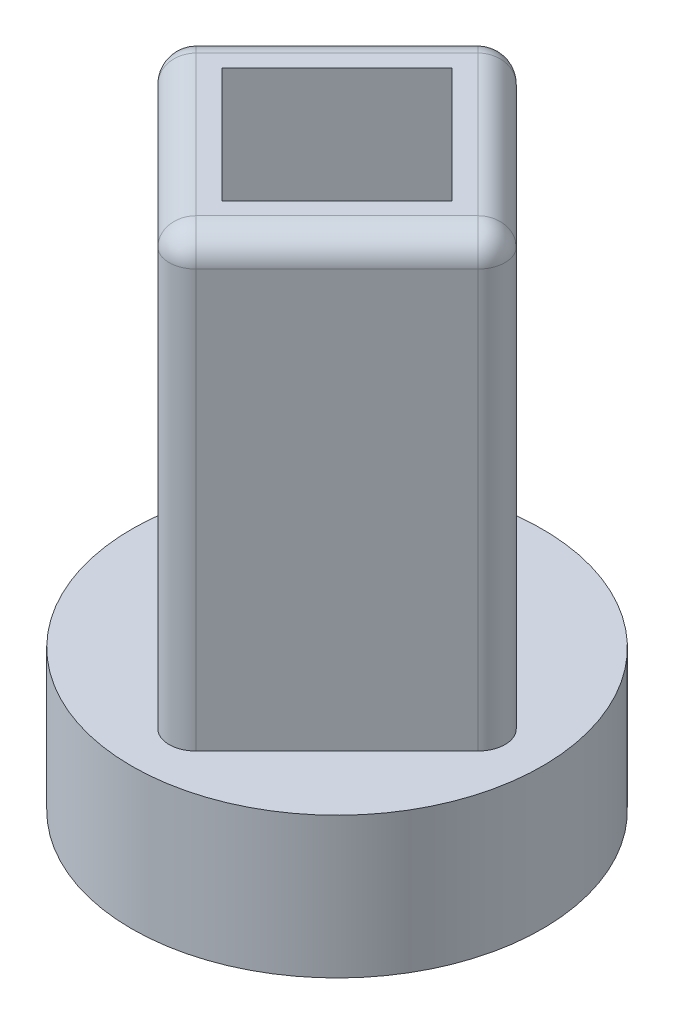
ISO-10303-21;
HEADER;
FILE_DESCRIPTION(('STEP AP214'),'2;1');
FILE_NAME('part.step','',(''),(''),'','','');
FILE_SCHEMA(('AUTOMOTIVE_DESIGN { 1 0 10303 214 1 1 1 1 }'));
ENDSEC;
DATA;
#1=APPLICATION_CONTEXT('core data for automotive mechanical design processes');
#2=APPLICATION_PROTOCOL_DEFINITION('international standard','automotive_design',2000,#1);
#3=PRODUCT_CONTEXT('',#1,'mechanical');
#4=PRODUCT('Part','Part','',(#3));
#5=PRODUCT_RELATED_PRODUCT_CATEGORY('part','',(#4));
#6=PRODUCT_DEFINITION_FORMATION('','',#4);
#7=PRODUCT_DEFINITION_CONTEXT('part definition',#1,'design');
#8=PRODUCT_DEFINITION('design','',#6,#7);
#9=PRODUCT_DEFINITION_SHAPE('','',#8);
#10=(LENGTH_UNIT() NAMED_UNIT(*) SI_UNIT(.MILLI.,.METRE.));
#11=(NAMED_UNIT(*) PLANE_ANGLE_UNIT() SI_UNIT($,.RADIAN.));
#12=(NAMED_UNIT(*) SI_UNIT($,.STERADIAN.) SOLID_ANGLE_UNIT());
#13=UNCERTAINTY_MEASURE_WITH_UNIT(LENGTH_MEASURE(1.E-05),#10,'distance_accuracy_value','');
#14=(GEOMETRIC_REPRESENTATION_CONTEXT(3) GLOBAL_UNCERTAINTY_ASSIGNED_CONTEXT((#13)) GLOBAL_UNIT_ASSIGNED_CONTEXT((#10,
#11,#12)) REPRESENTATION_CONTEXT('',''));
#15=CARTESIAN_POINT('',(0.,0.,0.));
#16=DIRECTION('',(0.,0.,1.));
#17=DIRECTION('',(1.,0.,0.));
#18=AXIS2_PLACEMENT_3D('',#15,#16,#17);
#19=CARTESIAN_POINT('',(0.,5.2,0.));
#20=DIRECTION('',(0.,1.,0.));
#21=DIRECTION('',(0.,0.,1.));
#22=AXIS2_PLACEMENT_3D('',#19,#20,#21);
#23=PLANE('',#22);
#24=CARTESIAN_POINT('',(0.,5.2,0.));
#25=DIRECTION('',(0.,1.,0.));
#26=DIRECTION('',(0.,0.,1.));
#27=AXIS2_PLACEMENT_3D('',#24,#25,#26);
#28=CIRCLE('',#27,7.575);
#29=CARTESIAN_POINT('',(0.,5.2,7.575));
#30=VERTEX_POINT('',#29);
#31=EDGE_CURVE('E253',#30,#30,#28,.T.);
#32=ORIENTED_EDGE('',*,*,#31,.T.);
#33=EDGE_LOOP('',(#32));
#34=FACE_BOUND('',#33,.T.);
#35=DIRECTION('',(-0.707106781186548,0.,-0.707106781186547));
#36=VECTOR('',#35,1.);
#37=CARTESIAN_POINT('',(6.61144840409422,5.2,0.));
#38=LINE('',#37,#36);
#39=CARTESIAN_POINT('',(5.90434162290767,5.2,-0.707106781186549));
#40=VERTEX_POINT('',#39);
#41=CARTESIAN_POINT('',(0.707106781186545,5.2,-5.90434162290767));
#42=VERTEX_POINT('',#41);
#43=EDGE_CURVE('E227',#40,#42,#38,.T.);
#44=ORIENTED_EDGE('',*,*,#43,.F.);
#45=CARTESIAN_POINT('',(5.19723484172112,5.2,0.));
#46=DIRECTION('',(0.,1.,0.));
#47=DIRECTION('',(0.,0.,1.));
#48=AXIS2_PLACEMENT_3D('',#45,#46,#47);
#49=CIRCLE('',#48,1.);
#50=CARTESIAN_POINT('',(5.90434162290767,5.2,0.707106781186546));
#51=VERTEX_POINT('',#50);
#52=EDGE_CURVE('E292',#40,#51,#49,.F.);
#53=ORIENTED_EDGE('',*,*,#52,.T.);
#54=DIRECTION('',(0.707106781186548,0.,-0.707106781186548));
#55=VECTOR('',#54,1.);
#56=CARTESIAN_POINT('',(0.,5.2,6.61144840409422));
#57=LINE('',#56,#55);
#58=CARTESIAN_POINT('',(0.707106781186548,5.2,5.90434162290767));
#59=VERTEX_POINT('',#58);
#60=EDGE_CURVE('E224',#59,#51,#57,.T.);
#61=ORIENTED_EDGE('',*,*,#60,.F.);
#62=CARTESIAN_POINT('',(0.,5.2,5.19723484172112));
#63=DIRECTION('',(0.,1.,0.));
#64=DIRECTION('',(0.,0.,1.));
#65=AXIS2_PLACEMENT_3D('',#62,#63,#64);
#66=CIRCLE('',#65,1.);
#67=CARTESIAN_POINT('',(-0.707106781186547,5.2,5.90434162290767));
#68=VERTEX_POINT('',#67);
#69=EDGE_CURVE('E294',#59,#68,#66,.F.);
#70=ORIENTED_EDGE('',*,*,#69,.T.);
#71=DIRECTION('',(0.707106781186548,0.,0.707106781186548));
#72=VECTOR('',#71,1.);
#73=CARTESIAN_POINT('',(-6.61144840409422,5.2,0.));
#74=LINE('',#73,#72);
#75=CARTESIAN_POINT('',(-5.90434162290767,5.2,0.707106781186549));
#76=VERTEX_POINT('',#75);
#77=EDGE_CURVE('E233',#76,#68,#74,.T.);
#78=ORIENTED_EDGE('',*,*,#77,.F.);
#79=CARTESIAN_POINT('',(-5.19723484172112,5.2,0.));
#80=DIRECTION('',(0.,1.,0.));
#81=DIRECTION('',(0.,0.,1.));
#82=AXIS2_PLACEMENT_3D('',#79,#80,#81);
#83=CIRCLE('',#82,1.);
#84=CARTESIAN_POINT('',(-5.90434162290767,5.2,-0.707106781186546));
#85=VERTEX_POINT('',#84);
#86=EDGE_CURVE('E50',#76,#85,#83,.F.);
#87=ORIENTED_EDGE('',*,*,#86,.T.);
#88=DIRECTION('',(-0.707106781186547,0.,0.707106781186548));
#89=VECTOR('',#88,1.);
#90=CARTESIAN_POINT('',(0.,5.2,-6.61144840409422));
#91=LINE('',#90,#89);
#92=CARTESIAN_POINT('',(-0.707106781186549,5.2,-5.90434162290767));
#93=VERTEX_POINT('',#92);
#94=EDGE_CURVE('E230',#93,#85,#91,.T.);
#95=ORIENTED_EDGE('',*,*,#94,.F.);
#96=CARTESIAN_POINT('',(0.,5.2,-5.19723484172112));
#97=DIRECTION('',(0.,1.,0.));
#98=DIRECTION('',(0.,0.,1.));
#99=AXIS2_PLACEMENT_3D('',#96,#97,#98);
#100=CIRCLE('',#99,1.);
#101=EDGE_CURVE('E11',#93,#42,#100,.F.);
#102=ORIENTED_EDGE('',*,*,#101,.T.);
#103=EDGE_LOOP('',(#44,#53,#61,#70,#78,#87,#95,#102));
#104=FACE_BOUND('',#103,.T.);
#105=ADVANCED_FACE('F41',(#34,#104),#23,.T.);
#106=CARTESIAN_POINT('',(0.,5.2,0.));
#107=DIRECTION('',(0.,-1.,0.));
#108=DIRECTION('',(0.,0.,-1.));
#109=AXIS2_PLACEMENT_3D('',#106,#107,#108);
#110=CYLINDRICAL_SURFACE('',#109,7.575);
#111=ORIENTED_EDGE('',*,*,#31,.F.);
#112=EDGE_LOOP('',(#111));
#113=FACE_BOUND('',#112,.T.);
#114=CARTESIAN_POINT('',(0.,0.,0.));
#115=DIRECTION('',(0.,1.,0.));
#116=DIRECTION('',(0.,0.,1.));
#117=AXIS2_PLACEMENT_3D('',#114,#115,#116);
#118=CIRCLE('',#117,7.575);
#119=CARTESIAN_POINT('',(0.,0.,7.575));
#120=VERTEX_POINT('',#119);
#121=EDGE_CURVE('E250',#120,#120,#118,.T.);
#122=ORIENTED_EDGE('',*,*,#121,.T.);
#123=EDGE_LOOP('',(#122));
#124=FACE_BOUND('',#123,.T.);
#125=ADVANCED_FACE('F404',(#113,#124),#110,.T.);
#126=CARTESIAN_POINT('',(0.,0.,0.));
#127=DIRECTION('',(0.,1.,0.));
#128=DIRECTION('',(0.,0.,1.));
#129=AXIS2_PLACEMENT_3D('',#126,#127,#128);
#130=PLANE('',#129);
#131=DIRECTION('',(0.80728342637673,0.,-0.590163934426229));
#132=VECTOR('',#131,1.);
#133=CARTESIAN_POINT('',(-4.35933050243434,0.,-1.38811475409836));
#134=LINE('',#133,#132);
#135=CARTESIAN_POINT('',(-4.35933050243434,0.,-1.38811475409836));
#136=VERTEX_POINT('',#135);
#137=CARTESIAN_POINT('',(0.,0.,-4.575));
#138=VERTEX_POINT('',#137);
#139=EDGE_CURVE('E241',#136,#138,#134,.T.);
#140=ORIENTED_EDGE('',*,*,#139,.F.);
#141=CARTESIAN_POINT('',(0.,0.,0.));
#142=DIRECTION('',(0.,-1.,0.));
#143=DIRECTION('',(0.,0.,-1.));
#144=AXIS2_PLACEMENT_3D('',#141,#142,#143);
#145=CIRCLE('',#144,4.575);
#146=EDGE_CURVE('E236',#138,#136,#145,.T.);
#147=ORIENTED_EDGE('',*,*,#146,.F.);
#148=EDGE_LOOP('',(#140,#147));
#149=FACE_BOUND('',#148,.T.);
#150=ORIENTED_EDGE('',*,*,#121,.F.);
#151=EDGE_LOOP('',(#150));
#152=FACE_BOUND('',#151,.T.);
#153=ADVANCED_FACE('F412',(#149,#152),#130,.F.);
#154=CARTESIAN_POINT('',(0.,3.6,0.));
#155=DIRECTION('',(0.,-1.,0.));
#156=DIRECTION('',(0.,0.,-1.));
#157=AXIS2_PLACEMENT_3D('',#154,#155,#156);
#158=CYLINDRICAL_SURFACE('',#157,4.575);
#159=ORIENTED_EDGE('',*,*,#146,.T.);
#160=DIRECTION('',(0.,-1.,0.));
#161=VECTOR('',#160,1.);
#162=CARTESIAN_POINT('',(-4.35933050243434,3.6,-1.38811475409836));
#163=LINE('',#162,#161);
#164=CARTESIAN_POINT('',(-4.35933050243434,3.6,-1.38811475409836));
#165=VERTEX_POINT('',#164);
#166=EDGE_CURVE('E244',#165,#136,#163,.T.);
#167=ORIENTED_EDGE('',*,*,#166,.F.);
#168=CARTESIAN_POINT('',(0.,3.6,0.));
#169=DIRECTION('',(0.,-1.,0.));
#170=DIRECTION('',(0.,0.,-1.));
#171=AXIS2_PLACEMENT_3D('',#168,#169,#170);
#172=CIRCLE('',#171,4.575);
#173=CARTESIAN_POINT('',(0.,3.6,-4.575));
#174=VERTEX_POINT('',#173);
#175=EDGE_CURVE('E237',#174,#165,#172,.T.);
#176=ORIENTED_EDGE('',*,*,#175,.F.);
#177=DIRECTION('',(0.,-1.,0.));
#178=VECTOR('',#177,1.);
#179=CARTESIAN_POINT('',(0.,3.6,-4.575));
#180=LINE('',#179,#178);
#181=EDGE_CURVE('E248',#174,#138,#180,.T.);
#182=ORIENTED_EDGE('',*,*,#181,.T.);
#183=EDGE_LOOP('',(#159,#167,#176,#182));
#184=FACE_BOUND('',#183,.T.);
#185=ADVANCED_FACE('F417',(#184),#158,.F.);
#186=CARTESIAN_POINT('',(-4.35933050243434,3.6,-1.38811475409836));
#187=DIRECTION('',(-0.590163934426229,0.,-0.80728342637673));
#188=DIRECTION('',(-0.80728342637673,0.,0.590163934426229));
#189=AXIS2_PLACEMENT_3D('',#186,#187,#188);
#190=PLANE('',#189);
#191=ORIENTED_EDGE('',*,*,#139,.T.);
#192=ORIENTED_EDGE('',*,*,#181,.F.);
#193=DIRECTION('',(0.80728342637673,0.,-0.590163934426229));
#194=VECTOR('',#193,1.);
#195=CARTESIAN_POINT('',(-4.35933050243434,3.6,-1.38811475409836));
#196=LINE('',#195,#194);
#197=EDGE_CURVE('E240',#165,#174,#196,.T.);
#198=ORIENTED_EDGE('',*,*,#197,.F.);
#199=ORIENTED_EDGE('',*,*,#166,.T.);
#200=EDGE_LOOP('',(#191,#192,#198,#199));
#201=FACE_BOUND('',#200,.T.);
#202=ADVANCED_FACE('F561',(#201),#190,.F.);
#203=CARTESIAN_POINT('',(0.,3.6,0.));
#204=DIRECTION('',(0.,-1.,0.));
#205=DIRECTION('',(0.,0.,-1.));
#206=AXIS2_PLACEMENT_3D('',#203,#204,#205);
#207=PLANE('',#206);
#208=CARTESIAN_POINT('',(0.,3.6,0.));
#209=DIRECTION('',(0.,-1.,0.));
#210=DIRECTION('',(0.,0.,-1.));
#211=AXIS2_PLACEMENT_3D('',#208,#209,#210);
#212=CIRCLE('',#211,2.875);
#213=CARTESIAN_POINT('',(-1.9,3.6,2.15768973673232));
#214=VERTEX_POINT('',#213);
#215=CARTESIAN_POINT('',(1.9,3.6,2.15768973673232));
#216=VERTEX_POINT('',#215);
#217=EDGE_CURVE('E58',#214,#216,#212,.T.);
#218=ORIENTED_EDGE('',*,*,#217,.F.);
#219=DIRECTION('',(-1.,0.,0.));
#220=VECTOR('',#219,1.);
#221=CARTESIAN_POINT('',(-1.9,3.6,2.15768973673232));
#222=LINE('',#221,#220);
#223=EDGE_CURVE('E181',#216,#214,#222,.T.);
#224=ORIENTED_EDGE('',*,*,#223,.F.);
#225=EDGE_LOOP('',(#218,#224));
#226=FACE_BOUND('',#225,.T.);
#227=ORIENTED_EDGE('',*,*,#175,.T.);
#228=ORIENTED_EDGE('',*,*,#197,.T.);
#229=EDGE_LOOP('',(#227,#228));
#230=FACE_BOUND('',#229,.T.);
#231=ADVANCED_FACE('F557',(#226,#230),#207,.T.);
#232=CARTESIAN_POINT('',(0.,21.6,0.));
#233=DIRECTION('',(0.,1.,0.));
#234=DIRECTION('',(0.,0.,1.));
#235=AXIS2_PLACEMENT_3D('',#232,#233,#234);
#236=PLANE('',#235);
#237=DIRECTION('',(-0.707106781186548,0.,-0.707106781186547));
#238=VECTOR('',#237,1.);
#239=CARTESIAN_POINT('',(-0.707106781186549,21.6,-5.90434162290767));
#240=LINE('',#239,#238);
#241=CARTESIAN_POINT('',(5.19723484172112,21.6,0.));
#242=VERTEX_POINT('',#241);
#243=CARTESIAN_POINT('',(0.,21.6,-5.19723484172112));
#244=VERTEX_POINT('',#243);
#245=EDGE_CURVE('E256',#242,#244,#240,.T.);
#246=ORIENTED_EDGE('',*,*,#245,.T.);
#247=DIRECTION('',(-0.707106781186547,0.,0.707106781186548));
#248=VECTOR('',#247,1.);
#249=CARTESIAN_POINT('',(-5.90434162290767,21.6,0.70710678118655));
#250=LINE('',#249,#248);
#251=CARTESIAN_POINT('',(-5.19723484172112,21.6,0.));
#252=VERTEX_POINT('',#251);
#253=EDGE_CURVE('E264',#244,#252,#250,.T.);
#254=ORIENTED_EDGE('',*,*,#253,.T.);
#255=DIRECTION('',(0.707106781186548,0.,0.707106781186547));
#256=VECTOR('',#255,1.);
#257=CARTESIAN_POINT('',(0.707106781186549,21.6,5.90434162290767));
#258=LINE('',#257,#256);
#259=CARTESIAN_POINT('',(0.,21.6,5.19723484172112));
#260=VERTEX_POINT('',#259);
#261=EDGE_CURVE('E262',#252,#260,#258,.T.);
#262=ORIENTED_EDGE('',*,*,#261,.T.);
#263=DIRECTION('',(0.707106781186548,0.,-0.707106781186548));
#264=VECTOR('',#263,1.);
#265=CARTESIAN_POINT('',(5.90434162290767,21.6,-0.707106781186549));
#266=LINE('',#265,#264);
#267=EDGE_CURVE('E260',#260,#242,#266,.T.);
#268=ORIENTED_EDGE('',*,*,#267,.T.);
#269=EDGE_LOOP('',(#246,#254,#262,#268));
#270=FACE_BOUND('',#269,.T.);
#271=DIRECTION('',(-0.707106781186548,0.,-0.707106781186547));
#272=VECTOR('',#271,1.);
#273=CARTESIAN_POINT('',(4.24264068711928,21.6,0.));
#274=LINE('',#273,#272);
#275=CARTESIAN_POINT('',(4.24264068711928,21.6,0.));
#276=VERTEX_POINT('',#275);
#277=CARTESIAN_POINT('',(0.,21.6,-4.24264068711928));
#278=VERTEX_POINT('',#277);
#279=EDGE_CURVE('E208',#276,#278,#274,.T.);
#280=ORIENTED_EDGE('',*,*,#279,.F.);
#281=DIRECTION('',(0.707106781186548,0.,-0.707106781186548));
#282=VECTOR('',#281,1.);
#283=CARTESIAN_POINT('',(0.,21.6,4.24264068711928));
#284=LINE('',#283,#282);
#285=CARTESIAN_POINT('',(0.,21.6,4.24264068711928));
#286=VERTEX_POINT('',#285);
#287=EDGE_CURVE('E206',#286,#276,#284,.T.);
#288=ORIENTED_EDGE('',*,*,#287,.F.);
#289=DIRECTION('',(0.707106781186548,0.,0.707106781186547));
#290=VECTOR('',#289,1.);
#291=CARTESIAN_POINT('',(-4.24264068711928,21.6,0.));
#292=LINE('',#291,#290);
#293=CARTESIAN_POINT('',(-4.24264068711928,21.6,0.));
#294=VERTEX_POINT('',#293);
#295=EDGE_CURVE('E213',#294,#286,#292,.T.);
#296=ORIENTED_EDGE('',*,*,#295,.F.);
#297=DIRECTION('',(-0.707106781186547,0.,0.707106781186548));
#298=VECTOR('',#297,1.);
#299=CARTESIAN_POINT('',(0.,21.6,-4.24264068711928));
#300=LINE('',#299,#298);
#301=EDGE_CURVE('E210',#278,#294,#300,.T.);
#302=ORIENTED_EDGE('',*,*,#301,.F.);
#303=EDGE_LOOP('',(#280,#288,#296,#302));
#304=FACE_BOUND('',#303,.T.);
#305=ADVANCED_FACE('F342',(#270,#304),#236,.T.);
#306=CARTESIAN_POINT('',(0.,21.6,6.61144840409422));
#307=DIRECTION('',(-0.707106781186548,0.,-0.707106781186548));
#308=DIRECTION('',(-0.707106781186548,0.,0.707106781186548));
#309=AXIS2_PLACEMENT_3D('',#306,#307,#308);
#310=PLANE('',#309);
#311=ORIENTED_EDGE('',*,*,#60,.T.);
#312=DIRECTION('',(0.,-1.,0.));
#313=VECTOR('',#312,1.);
#314=CARTESIAN_POINT('',(5.90434162290767,21.6,0.707106781186548));
#315=LINE('',#314,#313);
#316=CARTESIAN_POINT('',(5.90434162290767,20.6,0.707106781186547));
#317=VERTEX_POINT('',#316);
#318=EDGE_CURVE('E284',#51,#317,#315,.F.);
#319=ORIENTED_EDGE('',*,*,#318,.T.);
#320=DIRECTION('',(0.707106781186548,0.,-0.707106781186548));
#321=VECTOR('',#320,1.);
#322=CARTESIAN_POINT('',(0.,20.6,6.61144840409422));
#323=LINE('',#322,#321);
#324=CARTESIAN_POINT('',(0.707106781186548,20.6,5.90434162290767));
#325=VERTEX_POINT('',#324);
#326=EDGE_CURVE('E282',#317,#325,#323,.F.);
#327=ORIENTED_EDGE('',*,*,#326,.T.);
#328=DIRECTION('',(0.,-1.,0.));
#329=VECTOR('',#328,1.);
#330=CARTESIAN_POINT('',(0.707106781186547,21.6,5.90434162290767));
#331=LINE('',#330,#329);
#332=EDGE_CURVE('E280',#325,#59,#331,.T.);
#333=ORIENTED_EDGE('',*,*,#332,.T.);
#334=EDGE_LOOP('',(#311,#319,#327,#333));
#335=FACE_BOUND('',#334,.T.);
#336=ADVANCED_FACE('F353',(#335),#310,.F.);
#337=CARTESIAN_POINT('',(6.61144840409422,21.6,0.));
#338=DIRECTION('',(-0.707106781186547,0.,0.707106781186548));
#339=DIRECTION('',(0.707106781186548,0.,0.707106781186547));
#340=AXIS2_PLACEMENT_3D('',#337,#338,#339);
#341=PLANE('',#340);
#342=DIRECTION('',(-0.707106781186548,0.,-0.707106781186547));
#343=VECTOR('',#342,1.);
#344=CARTESIAN_POINT('',(6.61144840409422,20.6,0.));
#345=LINE('',#344,#343);
#346=CARTESIAN_POINT('',(0.707106781186545,20.6,-5.90434162290767));
#347=VERTEX_POINT('',#346);
#348=CARTESIAN_POINT('',(5.90434162290767,20.6,-0.707106781186549));
#349=VERTEX_POINT('',#348);
#350=EDGE_CURVE('E288',#347,#349,#345,.F.);
#351=ORIENTED_EDGE('',*,*,#350,.T.);
#352=DIRECTION('',(0.,-1.,0.));
#353=VECTOR('',#352,1.);
#354=CARTESIAN_POINT('',(5.90434162290767,21.6,-0.707106781186549));
#355=LINE('',#354,#353);
#356=EDGE_CURVE('E290',#349,#40,#355,.T.);
#357=ORIENTED_EDGE('',*,*,#356,.T.);
#358=ORIENTED_EDGE('',*,*,#43,.T.);
#359=DIRECTION('',(0.,-1.,0.));
#360=VECTOR('',#359,1.);
#361=CARTESIAN_POINT('',(0.707106781186544,21.6,-5.90434162290767));
#362=LINE('',#361,#360);
#363=EDGE_CURVE('E286',#42,#347,#362,.F.);
#364=ORIENTED_EDGE('',*,*,#363,.T.);
#365=EDGE_LOOP('',(#351,#357,#358,#364));
#366=FACE_BOUND('',#365,.T.);
#367=ADVANCED_FACE('F391',(#366),#341,.F.);
#368=CARTESIAN_POINT('',(0.,21.6,-6.61144840409422));
#369=DIRECTION('',(0.707106781186548,0.,0.707106781186547));
#370=DIRECTION('',(0.707106781186547,0.,-0.707106781186548));
#371=AXIS2_PLACEMENT_3D('',#368,#369,#370);
#372=PLANE('',#371);
#373=ORIENTED_EDGE('',*,*,#94,.T.);
#374=DIRECTION('',(0.,-1.,0.));
#375=VECTOR('',#374,1.);
#376=CARTESIAN_POINT('',(-5.90434162290767,21.6,-0.707106781186547));
#377=LINE('',#376,#375);
#378=CARTESIAN_POINT('',(-5.90434162290767,20.6,-0.707106781186546));
#379=VERTEX_POINT('',#378);
#380=EDGE_CURVE('E272',#85,#379,#377,.F.);
#381=ORIENTED_EDGE('',*,*,#380,.T.);
#382=DIRECTION('',(-0.707106781186547,0.,0.707106781186548));
#383=VECTOR('',#382,1.);
#384=CARTESIAN_POINT('',(0.,20.6,-6.61144840409422));
#385=LINE('',#384,#383);
#386=CARTESIAN_POINT('',(-0.707106781186549,20.6,-5.90434162290767));
#387=VERTEX_POINT('',#386);
#388=EDGE_CURVE('E269',#379,#387,#385,.F.);
#389=ORIENTED_EDGE('',*,*,#388,.T.);
#390=DIRECTION('',(0.,-1.,0.));
#391=VECTOR('',#390,1.);
#392=CARTESIAN_POINT('',(-0.707106781186549,21.6,-5.90434162290767));
#393=LINE('',#392,#391);
#394=EDGE_CURVE('E267',#387,#93,#393,.T.);
#395=ORIENTED_EDGE('',*,*,#394,.T.);
#396=EDGE_LOOP('',(#373,#381,#389,#395));
#397=FACE_BOUND('',#396,.T.);
#398=ADVANCED_FACE('F383',(#397),#372,.F.);
#399=CARTESIAN_POINT('',(-6.61144840409422,21.6,0.));
#400=DIRECTION('',(0.707106781186547,0.,-0.707106781186548));
#401=DIRECTION('',(-0.707106781186548,0.,-0.707106781186547));
#402=AXIS2_PLACEMENT_3D('',#399,#400,#401);
#403=PLANE('',#402);
#404=ORIENTED_EDGE('',*,*,#77,.T.);
#405=DIRECTION('',(0.,-1.,0.));
#406=VECTOR('',#405,1.);
#407=CARTESIAN_POINT('',(-0.707106781186548,21.6,5.90434162290767));
#408=LINE('',#407,#406);
#409=CARTESIAN_POINT('',(-0.707106781186548,20.6,5.90434162290767));
#410=VERTEX_POINT('',#409);
#411=EDGE_CURVE('E278',#68,#410,#408,.F.);
#412=ORIENTED_EDGE('',*,*,#411,.T.);
#413=DIRECTION('',(0.707106781186548,0.,0.707106781186547));
#414=VECTOR('',#413,1.);
#415=CARTESIAN_POINT('',(-6.61144840409422,20.6,0.));
#416=LINE('',#415,#414);
#417=CARTESIAN_POINT('',(-5.90434162290767,20.6,0.707106781186549));
#418=VERTEX_POINT('',#417);
#419=EDGE_CURVE('E276',#410,#418,#416,.F.);
#420=ORIENTED_EDGE('',*,*,#419,.T.);
#421=DIRECTION('',(0.,-1.,0.));
#422=VECTOR('',#421,1.);
#423=CARTESIAN_POINT('',(-5.90434162290767,21.6,0.707106781186549));
#424=LINE('',#423,#422);
#425=EDGE_CURVE('E274',#418,#76,#424,.T.);
#426=ORIENTED_EDGE('',*,*,#425,.T.);
#427=EDGE_LOOP('',(#404,#412,#420,#426));
#428=FACE_BOUND('',#427,.T.);
#429=ADVANCED_FACE('F366',(#428),#403,.F.);
#430=CARTESIAN_POINT('',(0.,21.6,4.24264068711928));
#431=DIRECTION('',(-0.707106781186548,0.,-0.707106781186548));
#432=DIRECTION('',(-0.707106781186548,0.,0.707106781186548));
#433=AXIS2_PLACEMENT_3D('',#430,#431,#432);
#434=PLANE('',#433);
#435=DIRECTION('',(0.707106781186548,0.,-0.707106781186548));
#436=VECTOR('',#435,1.);
#437=CARTESIAN_POINT('',(0.,10.05,4.24264068711928));
#438=LINE('',#437,#436);
#439=CARTESIAN_POINT('',(0.,10.05,4.24264068711928));
#440=VERTEX_POINT('',#439);
#441=CARTESIAN_POINT('',(4.24264068711928,10.05,0.));
#442=VERTEX_POINT('',#441);
#443=EDGE_CURVE('E198',#440,#442,#438,.T.);
#444=ORIENTED_EDGE('',*,*,#443,.F.);
#445=DIRECTION('',(0.,-1.,0.));
#446=VECTOR('',#445,1.);
#447=CARTESIAN_POINT('',(0.,21.6,4.24264068711928));
#448=LINE('',#447,#446);
#449=EDGE_CURVE('E215',#286,#440,#448,.T.);
#450=ORIENTED_EDGE('',*,*,#449,.F.);
#451=ORIENTED_EDGE('',*,*,#287,.T.);
#452=DIRECTION('',(0.,-1.,0.));
#453=VECTOR('',#452,1.);
#454=CARTESIAN_POINT('',(4.24264068711928,21.6,0.));
#455=LINE('',#454,#453);
#456=EDGE_CURVE('E222',#276,#442,#455,.T.);
#457=ORIENTED_EDGE('',*,*,#456,.T.);
#458=EDGE_LOOP('',(#444,#450,#451,#457));
#459=FACE_BOUND('',#458,.T.);
#460=ADVANCED_FACE('F500',(#459),#434,.T.);
#461=CARTESIAN_POINT('',(4.24264068711928,21.6,0.));
#462=DIRECTION('',(-0.707106781186547,0.,0.707106781186548));
#463=DIRECTION('',(0.707106781186548,0.,0.707106781186547));
#464=AXIS2_PLACEMENT_3D('',#461,#462,#463);
#465=PLANE('',#464);
#466=DIRECTION('',(-0.707106781186548,0.,-0.707106781186547));
#467=VECTOR('',#466,1.);
#468=CARTESIAN_POINT('',(4.24264068711928,10.05,0.));
#469=LINE('',#468,#467);
#470=CARTESIAN_POINT('',(0.,10.05,-4.24264068711928));
#471=VERTEX_POINT('',#470);
#472=EDGE_CURVE('E66',#442,#471,#469,.T.);
#473=ORIENTED_EDGE('',*,*,#472,.F.);
#474=ORIENTED_EDGE('',*,*,#456,.F.);
#475=ORIENTED_EDGE('',*,*,#279,.T.);
#476=DIRECTION('',(0.,-1.,0.));
#477=VECTOR('',#476,1.);
#478=CARTESIAN_POINT('',(0.,21.6,-4.24264068711928));
#479=LINE('',#478,#477);
#480=EDGE_CURVE('E220',#278,#471,#479,.T.);
#481=ORIENTED_EDGE('',*,*,#480,.T.);
#482=EDGE_LOOP('',(#473,#474,#475,#481));
#483=FACE_BOUND('',#482,.T.);
#484=ADVANCED_FACE('F504',(#483),#465,.T.);
#485=CARTESIAN_POINT('',(0.,21.6,-4.24264068711928));
#486=DIRECTION('',(0.707106781186548,0.,0.707106781186547));
#487=DIRECTION('',(0.707106781186547,0.,-0.707106781186548));
#488=AXIS2_PLACEMENT_3D('',#485,#486,#487);
#489=PLANE('',#488);
#490=DIRECTION('',(-0.707106781186547,0.,0.707106781186548));
#491=VECTOR('',#490,1.);
#492=CARTESIAN_POINT('',(0.,10.05,-4.24264068711928));
#493=LINE('',#492,#491);
#494=CARTESIAN_POINT('',(-4.24264068711928,10.05,0.));
#495=VERTEX_POINT('',#494);
#496=EDGE_CURVE('E202',#471,#495,#493,.T.);
#497=ORIENTED_EDGE('',*,*,#496,.F.);
#498=ORIENTED_EDGE('',*,*,#480,.F.);
#499=ORIENTED_EDGE('',*,*,#301,.T.);
#500=DIRECTION('',(0.,-1.,0.));
#501=VECTOR('',#500,1.);
#502=CARTESIAN_POINT('',(-4.24264068711928,21.6,0.));
#503=LINE('',#502,#501);
#504=EDGE_CURVE('E217',#294,#495,#503,.T.);
#505=ORIENTED_EDGE('',*,*,#504,.T.);
#506=EDGE_LOOP('',(#497,#498,#499,#505));
#507=FACE_BOUND('',#506,.T.);
#508=ADVANCED_FACE('F400',(#507),#489,.T.);
#509=CARTESIAN_POINT('',(-4.24264068711928,21.6,0.));
#510=DIRECTION('',(0.707106781186547,0.,-0.707106781186548));
#511=DIRECTION('',(-0.707106781186548,0.,-0.707106781186547));
#512=AXIS2_PLACEMENT_3D('',#509,#510,#511);
#513=PLANE('',#512);
#514=DIRECTION('',(0.707106781186548,0.,0.707106781186547));
#515=VECTOR('',#514,1.);
#516=CARTESIAN_POINT('',(-4.24264068711928,10.05,0.));
#517=LINE('',#516,#515);
#518=EDGE_CURVE('E193',#495,#440,#517,.T.);
#519=ORIENTED_EDGE('',*,*,#518,.F.);
#520=ORIENTED_EDGE('',*,*,#504,.F.);
#521=ORIENTED_EDGE('',*,*,#295,.T.);
#522=ORIENTED_EDGE('',*,*,#449,.T.);
#523=EDGE_LOOP('',(#519,#520,#521,#522));
#524=FACE_BOUND('',#523,.T.);
#525=ADVANCED_FACE('F394',(#524),#513,.T.);
#526=CARTESIAN_POINT('',(5.19723484172112,21.6,0.));
#527=DIRECTION('',(0.,-1.,0.));
#528=DIRECTION('',(0.,0.,-1.));
#529=AXIS2_PLACEMENT_3D('',#526,#527,#528);
#530=CYLINDRICAL_SURFACE('',#529,1.);
#531=ORIENTED_EDGE('',*,*,#52,.F.);
#532=ORIENTED_EDGE('',*,*,#356,.F.);
#533=CARTESIAN_POINT('',(5.19723484172112,20.6,0.));
#534=DIRECTION('',(0.,1.,0.));
#535=DIRECTION('',(0.,0.,1.));
#536=AXIS2_PLACEMENT_3D('',#533,#534,#535);
#537=CIRCLE('',#536,1.);
#538=EDGE_CURVE('E45',#317,#349,#537,.T.);
#539=ORIENTED_EDGE('',*,*,#538,.F.);
#540=ORIENTED_EDGE('',*,*,#318,.F.);
#541=EDGE_LOOP('',(#531,#532,#539,#540));
#542=FACE_BOUND('',#541,.T.);
#543=ADVANCED_FACE('F43',(#542),#530,.T.);
#544=CARTESIAN_POINT('',(2.59861742086056,20.6,2.59861742086056));
#545=DIRECTION('',(-0.707106781186548,0.,0.707106781186548));
#546=DIRECTION('',(0.707106781186548,0.,0.707106781186548));
#547=AXIS2_PLACEMENT_3D('',#544,#545,#546);
#548=CYLINDRICAL_SURFACE('',#547,1.);
#549=CARTESIAN_POINT('',(0.,20.6,5.19723484172112));
#550=DIRECTION('',(-0.707106781186547,0.,0.707106781186547));
#551=DIRECTION('',(0.707106781186548,0.,0.707106781186548));
#552=AXIS2_PLACEMENT_3D('',#549,#550,#551);
#553=CIRCLE('',#552,1.);
#554=EDGE_CURVE('E321',#325,#260,#553,.T.);
#555=ORIENTED_EDGE('',*,*,#554,.F.);
#556=ORIENTED_EDGE('',*,*,#326,.F.);
#557=CARTESIAN_POINT('',(5.19723484172112,20.6,0.));
#558=DIRECTION('',(0.707106781186548,0.,-0.707106781186547));
#559=DIRECTION('',(-0.707106781186547,0.,-0.707106781186548));
#560=AXIS2_PLACEMENT_3D('',#557,#558,#559);
#561=CIRCLE('',#560,1.);
#562=EDGE_CURVE('E323',#242,#317,#561,.T.);
#563=ORIENTED_EDGE('',*,*,#562,.F.);
#564=ORIENTED_EDGE('',*,*,#267,.F.);
#565=EDGE_LOOP('',(#555,#556,#563,#564));
#566=FACE_BOUND('',#565,.T.);
#567=ADVANCED_FACE('F350',(#566),#548,.T.);
#568=CARTESIAN_POINT('',(0.,21.6,5.19723484172112));
#569=DIRECTION('',(0.,-1.,0.));
#570=DIRECTION('',(0.,0.,-1.));
#571=AXIS2_PLACEMENT_3D('',#568,#569,#570);
#572=CYLINDRICAL_SURFACE('',#571,1.);
#573=ORIENTED_EDGE('',*,*,#69,.F.);
#574=ORIENTED_EDGE('',*,*,#332,.F.);
#575=CARTESIAN_POINT('',(0.,20.6,5.19723484172112));
#576=DIRECTION('',(0.,1.,0.));
#577=DIRECTION('',(0.,0.,1.));
#578=AXIS2_PLACEMENT_3D('',#575,#576,#577);
#579=CIRCLE('',#578,1.);
#580=EDGE_CURVE('E318',#410,#325,#579,.T.);
#581=ORIENTED_EDGE('',*,*,#580,.F.);
#582=ORIENTED_EDGE('',*,*,#411,.F.);
#583=EDGE_LOOP('',(#573,#574,#581,#582));
#584=FACE_BOUND('',#583,.T.);
#585=ADVANCED_FACE('F358',(#584),#572,.T.);
#586=CARTESIAN_POINT('',(5.19723484172112,20.6,0.));
#587=DIRECTION('',(0.707106781186548,0.,0.707106781186547));
#588=DIRECTION('',(0.707106781186547,0.,-0.707106781186548));
#589=AXIS2_PLACEMENT_3D('',#586,#587,#588);
#590=SPHERICAL_SURFACE('',#589,1.);
#591=ORIENTED_EDGE('',*,*,#562,.T.);
#592=ORIENTED_EDGE('',*,*,#538,.T.);
#593=CARTESIAN_POINT('',(5.19723484172112,20.6,0.));
#594=DIRECTION('',(0.707106781186548,0.,0.707106781186547));
#595=DIRECTION('',(0.707106781186547,0.,-0.707106781186548));
#596=AXIS2_PLACEMENT_3D('',#593,#594,#595);
#597=CIRCLE('',#596,1.);
#598=EDGE_CURVE('E315',#242,#349,#597,.F.);
#599=ORIENTED_EDGE('',*,*,#598,.F.);
#600=EDGE_LOOP('',(#591,#592,#599));
#601=FACE_BOUND('',#600,.T.);
#602=ADVANCED_FACE('F330',(#601),#590,.T.);
#603=CARTESIAN_POINT('',(0.,20.6,5.19723484172112));
#604=DIRECTION('',(0.707106781186547,0.,0.707106781186548));
#605=DIRECTION('',(0.707106781186548,0.,-0.707106781186547));
#606=AXIS2_PLACEMENT_3D('',#603,#604,#605);
#607=SPHERICAL_SURFACE('',#606,1.);
#608=ORIENTED_EDGE('',*,*,#580,.T.);
#609=ORIENTED_EDGE('',*,*,#554,.T.);
#610=CARTESIAN_POINT('',(0.,20.6,5.19723484172112));
#611=DIRECTION('',(0.707106781186548,0.,0.707106781186547));
#612=DIRECTION('',(0.707106781186547,0.,-0.707106781186548));
#613=AXIS2_PLACEMENT_3D('',#610,#611,#612);
#614=CIRCLE('',#613,1.);
#615=EDGE_CURVE('E312',#410,#260,#614,.F.);
#616=ORIENTED_EDGE('',*,*,#615,.F.);
#617=EDGE_LOOP('',(#608,#609,#616));
#618=FACE_BOUND('',#617,.T.);
#619=ADVANCED_FACE('F439',(#618),#607,.T.);
#620=CARTESIAN_POINT('',(0.,21.6,-5.19723484172112));
#621=DIRECTION('',(0.,-1.,0.));
#622=DIRECTION('',(0.,0.,-1.));
#623=AXIS2_PLACEMENT_3D('',#620,#621,#622);
#624=CYLINDRICAL_SURFACE('',#623,1.);
#625=ORIENTED_EDGE('',*,*,#101,.F.);
#626=ORIENTED_EDGE('',*,*,#394,.F.);
#627=CARTESIAN_POINT('',(0.,20.6,-5.19723484172112));
#628=DIRECTION('',(0.,1.,0.));
#629=DIRECTION('',(0.,0.,1.));
#630=AXIS2_PLACEMENT_3D('',#627,#628,#629);
#631=CIRCLE('',#630,1.);
#632=EDGE_CURVE('E309',#347,#387,#631,.T.);
#633=ORIENTED_EDGE('',*,*,#632,.F.);
#634=ORIENTED_EDGE('',*,*,#363,.F.);
#635=EDGE_LOOP('',(#625,#626,#633,#634));
#636=FACE_BOUND('',#635,.T.);
#637=ADVANCED_FACE('F389',(#636),#624,.T.);
#638=CARTESIAN_POINT('',(2.59861742086056,20.6,-2.59861742086056));
#639=DIRECTION('',(0.707106781186548,0.,0.707106781186547));
#640=DIRECTION('',(0.707106781186547,0.,-0.707106781186548));
#641=AXIS2_PLACEMENT_3D('',#638,#639,#640);
#642=CYLINDRICAL_SURFACE('',#641,1.);
#643=ORIENTED_EDGE('',*,*,#598,.T.);
#644=ORIENTED_EDGE('',*,*,#350,.F.);
#645=CARTESIAN_POINT('',(0.,20.6,-5.19723484172112));
#646=DIRECTION('',(-0.707106781186548,0.,-0.707106781186547));
#647=DIRECTION('',(-0.707106781186547,0.,0.707106781186548));
#648=AXIS2_PLACEMENT_3D('',#645,#646,#647);
#649=CIRCLE('',#648,1.);
#650=EDGE_CURVE('E306',#244,#347,#649,.T.);
#651=ORIENTED_EDGE('',*,*,#650,.F.);
#652=ORIENTED_EDGE('',*,*,#245,.F.);
#653=EDGE_LOOP('',(#643,#644,#651,#652));
#654=FACE_BOUND('',#653,.T.);
#655=ADVANCED_FACE('F337',(#654),#642,.T.);
#656=CARTESIAN_POINT('',(-2.59861742086056,20.6,2.59861742086056));
#657=DIRECTION('',(-0.707106781186548,0.,-0.707106781186547));
#658=DIRECTION('',(-0.707106781186547,0.,0.707106781186548));
#659=AXIS2_PLACEMENT_3D('',#656,#657,#658);
#660=CYLINDRICAL_SURFACE('',#659,1.);
#661=ORIENTED_EDGE('',*,*,#615,.T.);
#662=ORIENTED_EDGE('',*,*,#261,.F.);
#663=CARTESIAN_POINT('',(-5.19723484172112,20.6,0.));
#664=DIRECTION('',(-0.707106781186548,0.,-0.707106781186547));
#665=DIRECTION('',(-0.707106781186547,0.,0.707106781186548));
#666=AXIS2_PLACEMENT_3D('',#663,#664,#665);
#667=CIRCLE('',#666,1.);
#668=EDGE_CURVE('E303',#418,#252,#667,.T.);
#669=ORIENTED_EDGE('',*,*,#668,.F.);
#670=ORIENTED_EDGE('',*,*,#419,.F.);
#671=EDGE_LOOP('',(#661,#662,#669,#670));
#672=FACE_BOUND('',#671,.T.);
#673=ADVANCED_FACE('F376',(#672),#660,.T.);
#674=CARTESIAN_POINT('',(-5.19723484172112,21.6,0.));
#675=DIRECTION('',(0.,-1.,0.));
#676=DIRECTION('',(0.,0.,-1.));
#677=AXIS2_PLACEMENT_3D('',#674,#675,#676);
#678=CYLINDRICAL_SURFACE('',#677,1.);
#679=ORIENTED_EDGE('',*,*,#86,.F.);
#680=ORIENTED_EDGE('',*,*,#425,.F.);
#681=CARTESIAN_POINT('',(-5.19723484172112,20.6,0.));
#682=DIRECTION('',(0.,1.,0.));
#683=DIRECTION('',(0.,0.,1.));
#684=AXIS2_PLACEMENT_3D('',#681,#682,#683);
#685=CIRCLE('',#684,1.);
#686=EDGE_CURVE('E300',#379,#418,#685,.T.);
#687=ORIENTED_EDGE('',*,*,#686,.F.);
#688=ORIENTED_EDGE('',*,*,#380,.F.);
#689=EDGE_LOOP('',(#679,#680,#687,#688));
#690=FACE_BOUND('',#689,.T.);
#691=ADVANCED_FACE('F372',(#690),#678,.T.);
#692=CARTESIAN_POINT('',(0.,20.6,-5.19723484172112));
#693=DIRECTION('',(0.707106781186547,0.,-0.707106781186548));
#694=DIRECTION('',(-0.707106781186548,0.,-0.707106781186547));
#695=AXIS2_PLACEMENT_3D('',#692,#693,#694);
#696=SPHERICAL_SURFACE('',#695,1.);
#697=ORIENTED_EDGE('',*,*,#650,.T.);
#698=ORIENTED_EDGE('',*,*,#632,.T.);
#699=CARTESIAN_POINT('',(0.,20.6,-5.19723484172112));
#700=DIRECTION('',(0.707106781186547,0.,-0.707106781186548));
#701=DIRECTION('',(-0.707106781186548,0.,-0.707106781186547));
#702=AXIS2_PLACEMENT_3D('',#699,#700,#701);
#703=CIRCLE('',#702,1.);
#704=EDGE_CURVE('E298',#244,#387,#703,.F.);
#705=ORIENTED_EDGE('',*,*,#704,.F.);
#706=EDGE_LOOP('',(#697,#698,#705));
#707=FACE_BOUND('',#706,.T.);
#708=ADVANCED_FACE('F427',(#707),#696,.T.);
#709=CARTESIAN_POINT('',(-5.19723484172112,20.6,0.));
#710=DIRECTION('',(-0.707106781186547,0.,0.707106781186548));
#711=DIRECTION('',(0.707106781186548,0.,0.707106781186547));
#712=AXIS2_PLACEMENT_3D('',#709,#710,#711);
#713=SPHERICAL_SURFACE('',#712,1.);
#714=ORIENTED_EDGE('',*,*,#686,.T.);
#715=ORIENTED_EDGE('',*,*,#668,.T.);
#716=CARTESIAN_POINT('',(-5.19723484172112,20.6,0.));
#717=DIRECTION('',(-0.707106781186548,0.,0.707106781186547));
#718=DIRECTION('',(0.707106781186547,0.,0.707106781186548));
#719=AXIS2_PLACEMENT_3D('',#716,#717,#718);
#720=CIRCLE('',#719,1.);
#721=EDGE_CURVE('E205',#379,#252,#720,.F.);
#722=ORIENTED_EDGE('',*,*,#721,.F.);
#723=EDGE_LOOP('',(#714,#715,#722));
#724=FACE_BOUND('',#723,.T.);
#725=ADVANCED_FACE('F379',(#724),#713,.T.);
#726=CARTESIAN_POINT('',(-2.59861742086056,20.6,-2.59861742086056));
#727=DIRECTION('',(0.707106781186547,0.,-0.707106781186548));
#728=DIRECTION('',(-0.707106781186548,0.,-0.707106781186547));
#729=AXIS2_PLACEMENT_3D('',#726,#727,#728);
#730=CYLINDRICAL_SURFACE('',#729,1.);
#731=ORIENTED_EDGE('',*,*,#704,.T.);
#732=ORIENTED_EDGE('',*,*,#388,.F.);
#733=ORIENTED_EDGE('',*,*,#721,.T.);
#734=ORIENTED_EDGE('',*,*,#253,.F.);
#735=EDGE_LOOP('',(#731,#732,#733,#734));
#736=FACE_BOUND('',#735,.T.);
#737=ADVANCED_FACE('F381',(#736),#730,.T.);
#738=CARTESIAN_POINT('',(0.,10.05,0.));
#739=DIRECTION('',(0.,1.,0.));
#740=DIRECTION('',(0.,0.,1.));
#741=AXIS2_PLACEMENT_3D('',#738,#739,#740);
#742=PLANE('',#741);
#743=CARTESIAN_POINT('',(0.,10.05,0.));
#744=DIRECTION('',(0.,1.,0.));
#745=DIRECTION('',(0.,0.,1.));
#746=AXIS2_PLACEMENT_3D('',#743,#744,#745);
#747=CIRCLE('',#746,1.875);
#748=CARTESIAN_POINT('',(0.,10.05,1.875));
#749=VERTEX_POINT('',#748);
#750=EDGE_CURVE('E188',#749,#749,#747,.T.);
#751=ORIENTED_EDGE('',*,*,#750,.F.);
#752=EDGE_LOOP('',(#751));
#753=FACE_BOUND('',#752,.T.);
#754=ORIENTED_EDGE('',*,*,#518,.T.);
#755=ORIENTED_EDGE('',*,*,#443,.T.);
#756=ORIENTED_EDGE('',*,*,#472,.T.);
#757=ORIENTED_EDGE('',*,*,#496,.T.);
#758=EDGE_LOOP('',(#754,#755,#756,#757));
#759=FACE_BOUND('',#758,.T.);
#760=ADVANCED_FACE('F424',(#753,#759),#742,.T.);
#761=CARTESIAN_POINT('',(0.,12.6,0.));
#762=DIRECTION('',(0.,-1.,0.));
#763=DIRECTION('',(0.,0.,-1.));
#764=AXIS2_PLACEMENT_3D('',#761,#762,#763);
#765=CYLINDRICAL_SURFACE('',#764,1.875);
#766=CARTESIAN_POINT('',(0.,12.6,0.));
#767=DIRECTION('',(0.,1.,0.));
#768=DIRECTION('',(0.,0.,1.));
#769=AXIS2_PLACEMENT_3D('',#766,#767,#768);
#770=CIRCLE('',#769,1.875);
#771=CARTESIAN_POINT('',(0.,12.6,1.875));
#772=VERTEX_POINT('',#771);
#773=EDGE_CURVE('E190',#772,#772,#770,.T.);
#774=ORIENTED_EDGE('',*,*,#773,.F.);
#775=EDGE_LOOP('',(#774));
#776=FACE_BOUND('',#775,.T.);
#777=ORIENTED_EDGE('',*,*,#750,.T.);
#778=EDGE_LOOP('',(#777));
#779=FACE_BOUND('',#778,.T.);
#780=ADVANCED_FACE('F533',(#776,#779),#765,.T.);
#781=CARTESIAN_POINT('',(0.,12.6,0.));
#782=DIRECTION('',(0.,1.,0.));
#783=DIRECTION('',(0.,0.,1.));
#784=AXIS2_PLACEMENT_3D('',#781,#782,#783);
#785=PLANE('',#784);
#786=ORIENTED_EDGE('',*,*,#773,.T.);
#787=EDGE_LOOP('',(#786));
#788=FACE_BOUND('',#787,.T.);
#789=ADVANCED_FACE('F542',(#788),#785,.T.);
#790=CARTESIAN_POINT('',(0.,7.6,0.));
#791=DIRECTION('',(0.,-1.,0.));
#792=DIRECTION('',(0.,0.,-1.));
#793=AXIS2_PLACEMENT_3D('',#790,#791,#792);
#794=CYLINDRICAL_SURFACE('',#793,2.875);
#795=ORIENTED_EDGE('',*,*,#217,.T.);
#796=DIRECTION('',(0.,-1.,0.));
#797=VECTOR('',#796,1.);
#798=CARTESIAN_POINT('',(1.9,7.6,2.15768973673232));
#799=LINE('',#798,#797);
#800=CARTESIAN_POINT('',(1.9,7.6,2.15768973673232));
#801=VERTEX_POINT('',#800);
#802=EDGE_CURVE('E167',#801,#216,#799,.T.);
#803=ORIENTED_EDGE('',*,*,#802,.F.);
#804=CARTESIAN_POINT('',(0.,7.6,0.));
#805=DIRECTION('',(0.,-1.,0.));
#806=DIRECTION('',(0.,0.,-1.));
#807=AXIS2_PLACEMENT_3D('',#804,#805,#806);
#808=CIRCLE('',#807,2.875);
#809=CARTESIAN_POINT('',(-1.9,7.6,2.15768973673232));
#810=VERTEX_POINT('',#809);
#811=EDGE_CURVE('E170',#810,#801,#808,.T.);
#812=ORIENTED_EDGE('',*,*,#811,.F.);
#813=DIRECTION('',(0.,-1.,0.));
#814=VECTOR('',#813,1.);
#815=CARTESIAN_POINT('',(-1.9,7.6,2.15768973673232));
#816=LINE('',#815,#814);
#817=EDGE_CURVE('E176',#810,#214,#816,.T.);
#818=ORIENTED_EDGE('',*,*,#817,.T.);
#819=EDGE_LOOP('',(#795,#803,#812,#818));
#820=FACE_BOUND('',#819,.T.);
#821=ADVANCED_FACE('F169',(#820),#794,.F.);
#822=CARTESIAN_POINT('',(-1.9,7.6,2.15768973673232));
#823=DIRECTION('',(0.,0.,1.));
#824=DIRECTION('',(1.,0.,0.));
#825=AXIS2_PLACEMENT_3D('',#822,#823,#824);
#826=PLANE('',#825);
#827=ORIENTED_EDGE('',*,*,#223,.T.);
#828=ORIENTED_EDGE('',*,*,#817,.F.);
#829=DIRECTION('',(-1.,0.,0.));
#830=VECTOR('',#829,1.);
#831=CARTESIAN_POINT('',(-1.9,7.6,2.15768973673232));
#832=LINE('',#831,#830);
#833=EDGE_CURVE('E177',#801,#810,#832,.T.);
#834=ORIENTED_EDGE('',*,*,#833,.F.);
#835=ORIENTED_EDGE('',*,*,#802,.T.);
#836=EDGE_LOOP('',(#827,#828,#834,#835));
#837=FACE_BOUND('',#836,.T.);
#838=ADVANCED_FACE('F183',(#837),#826,.F.);
#839=CARTESIAN_POINT('',(0.,7.6,0.));
#840=DIRECTION('',(0.,-1.,0.));
#841=DIRECTION('',(0.,0.,-1.));
#842=AXIS2_PLACEMENT_3D('',#839,#840,#841);
#843=PLANE('',#842);
#844=ORIENTED_EDGE('',*,*,#811,.T.);
#845=ORIENTED_EDGE('',*,*,#833,.T.);
#846=EDGE_LOOP('',(#844,#845));
#847=FACE_BOUND('',#846,.T.);
#848=ADVANCED_FACE('F180',(#847),#843,.T.);
#849=CLOSED_SHELL('',(#105,#125,#153,#185,#202,#231,#305,#336,#367,#398,#429,#460,#484,#508,
#525,#543,#567,#585,#602,#619,#637,#655,#673,#691,#708,#725,#737,#760,#780,#789,#821,#838,#848));
#850=MANIFOLD_SOLID_BREP('B2',#849);
#851=ADVANCED_BREP_SHAPE_REPRESENTATION('',(#18,#850),#14);
#852=SHAPE_DEFINITION_REPRESENTATION(#9,#851);
ENDSEC;
END-ISO-10303-21;
